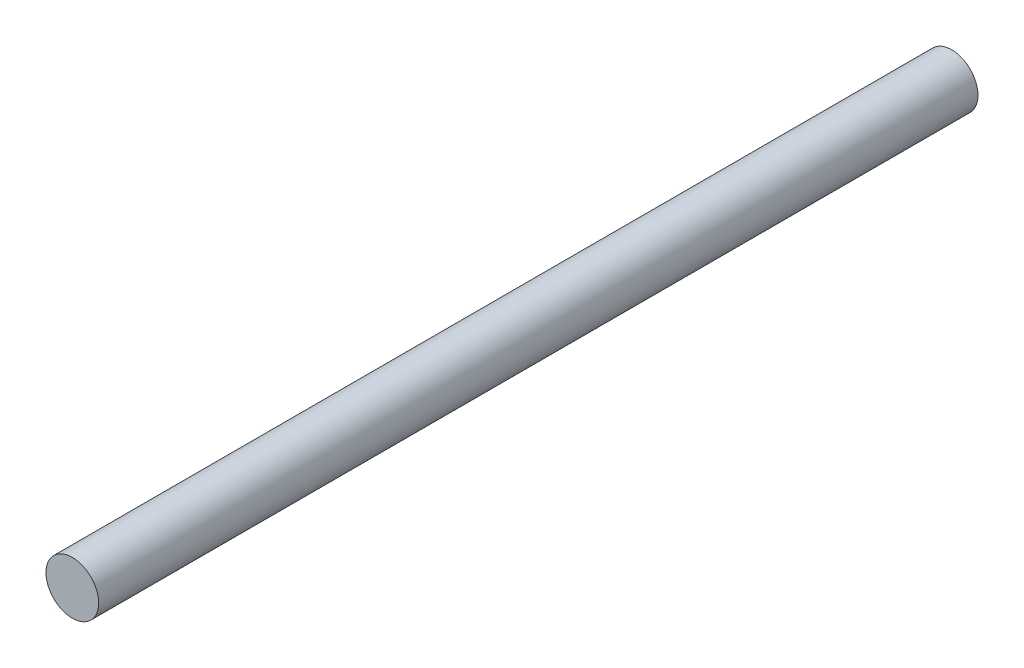
ISO-10303-21;
HEADER;
FILE_DESCRIPTION(('STEP AP214'),'2;1');
FILE_NAME('part.step','',(''),(''),'','','');
FILE_SCHEMA(('AUTOMOTIVE_DESIGN { 1 0 10303 214 1 1 1 1 }'));
ENDSEC;
DATA;
#1=APPLICATION_CONTEXT('core data for automotive mechanical design processes');
#2=APPLICATION_PROTOCOL_DEFINITION('international standard','automotive_design',2000,#1);
#3=PRODUCT_CONTEXT('',#1,'mechanical');
#4=PRODUCT('Part','Part','',(#3));
#5=PRODUCT_RELATED_PRODUCT_CATEGORY('part','',(#4));
#6=PRODUCT_DEFINITION_FORMATION('','',#4);
#7=PRODUCT_DEFINITION_CONTEXT('part definition',#1,'design');
#8=PRODUCT_DEFINITION('design','',#6,#7);
#9=PRODUCT_DEFINITION_SHAPE('','',#8);
#10=(LENGTH_UNIT() NAMED_UNIT(*) SI_UNIT(.MILLI.,.METRE.));
#11=(NAMED_UNIT(*) PLANE_ANGLE_UNIT() SI_UNIT($,.RADIAN.));
#12=(NAMED_UNIT(*) SI_UNIT($,.STERADIAN.) SOLID_ANGLE_UNIT());
#13=UNCERTAINTY_MEASURE_WITH_UNIT(LENGTH_MEASURE(1.E-05),#10,'distance_accuracy_value','');
#14=(GEOMETRIC_REPRESENTATION_CONTEXT(3) GLOBAL_UNCERTAINTY_ASSIGNED_CONTEXT((#13)) GLOBAL_UNIT_ASSIGNED_CONTEXT((#10,
#11,#12)) REPRESENTATION_CONTEXT('',''));
#15=CARTESIAN_POINT('',(0.,0.,0.));
#16=DIRECTION('',(0.,0.,1.));
#17=DIRECTION('',(1.,0.,0.));
#18=AXIS2_PLACEMENT_3D('',#15,#16,#17);
#19=CARTESIAN_POINT('',(0.,0.,150.));
#20=DIRECTION('',(0.,0.,-1.));
#21=DIRECTION('',(-1.,0.,0.));
#22=AXIS2_PLACEMENT_3D('',#19,#20,#21);
#23=CYLINDRICAL_SURFACE('',#22,4.5);
#24=CARTESIAN_POINT('',(0.,0.,150.));
#25=DIRECTION('',(0.,0.,1.));
#26=DIRECTION('',(1.,0.,0.));
#27=AXIS2_PLACEMENT_3D('',#24,#25,#26);
#28=CIRCLE('',#27,4.5);
#29=CARTESIAN_POINT('',(4.5,0.,150.));
#30=VERTEX_POINT('',#29);
#31=EDGE_CURVE('E10',#30,#30,#28,.T.);
#32=ORIENTED_EDGE('',*,*,#31,.F.);
#33=EDGE_LOOP('',(#32));
#34=FACE_BOUND('',#33,.T.);
#35=CARTESIAN_POINT('',(0.,0.,0.));
#36=DIRECTION('',(0.,0.,1.));
#37=DIRECTION('',(1.,0.,0.));
#38=AXIS2_PLACEMENT_3D('',#35,#36,#37);
#39=CIRCLE('',#38,4.5);
#40=CARTESIAN_POINT('',(4.5,0.,0.));
#41=VERTEX_POINT('',#40);
#42=EDGE_CURVE('E44',#41,#41,#39,.T.);
#43=ORIENTED_EDGE('',*,*,#42,.T.);
#44=EDGE_LOOP('',(#43));
#45=FACE_BOUND('',#44,.T.);
#46=ADVANCED_FACE('F41',(#34,#45),#23,.T.);
#47=CARTESIAN_POINT('',(0.,0.,150.));
#48=DIRECTION('',(0.,0.,1.));
#49=DIRECTION('',(1.,0.,0.));
#50=AXIS2_PLACEMENT_3D('',#47,#48,#49);
#51=PLANE('',#50);
#52=ORIENTED_EDGE('',*,*,#31,.T.);
#53=EDGE_LOOP('',(#52));
#54=FACE_BOUND('',#53,.T.);
#55=ADVANCED_FACE('F58',(#54),#51,.T.);
#56=CARTESIAN_POINT('',(0.,0.,0.));
#57=DIRECTION('',(0.,0.,1.));
#58=DIRECTION('',(1.,0.,0.));
#59=AXIS2_PLACEMENT_3D('',#56,#57,#58);
#60=PLANE('',#59);
#61=ORIENTED_EDGE('',*,*,#42,.F.);
#62=EDGE_LOOP('',(#61));
#63=FACE_BOUND('',#62,.T.);
#64=ADVANCED_FACE('F56',(#63),#60,.F.);
#65=CLOSED_SHELL('',(#46,#55,#64));
#66=MANIFOLD_SOLID_BREP('B2',#65);
#67=ADVANCED_BREP_SHAPE_REPRESENTATION('',(#18,#66),#14);
#68=SHAPE_DEFINITION_REPRESENTATION(#9,#67);
ENDSEC;
END-ISO-10303-21;
